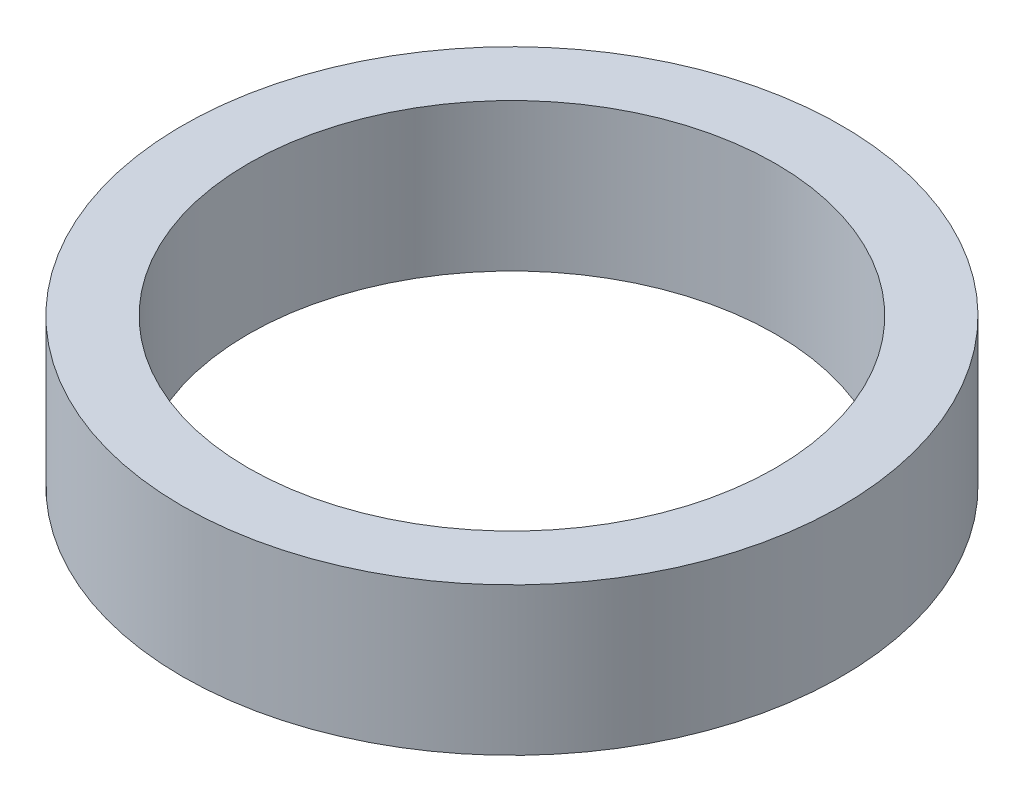
ISO-10303-21;
HEADER;
FILE_DESCRIPTION(('STEP AP214'),'2;1');
FILE_NAME('part.step','',(''),(''),'','','');
FILE_SCHEMA(('AUTOMOTIVE_DESIGN { 1 0 10303 214 1 1 1 1 }'));
ENDSEC;
DATA;
#1=APPLICATION_CONTEXT('core data for automotive mechanical design processes');
#2=APPLICATION_PROTOCOL_DEFINITION('international standard','automotive_design',2000,#1);
#3=PRODUCT_CONTEXT('',#1,'mechanical');
#4=PRODUCT('Part','Part','',(#3));
#5=PRODUCT_RELATED_PRODUCT_CATEGORY('part','',(#4));
#6=PRODUCT_DEFINITION_FORMATION('','',#4);
#7=PRODUCT_DEFINITION_CONTEXT('part definition',#1,'design');
#8=PRODUCT_DEFINITION('design','',#6,#7);
#9=PRODUCT_DEFINITION_SHAPE('','',#8);
#10=(LENGTH_UNIT() NAMED_UNIT(*) SI_UNIT(.MILLI.,.METRE.));
#11=(NAMED_UNIT(*) PLANE_ANGLE_UNIT() SI_UNIT($,.RADIAN.));
#12=(NAMED_UNIT(*) SI_UNIT($,.STERADIAN.) SOLID_ANGLE_UNIT());
#13=UNCERTAINTY_MEASURE_WITH_UNIT(LENGTH_MEASURE(1.E-05),#10,'distance_accuracy_value','');
#14=(GEOMETRIC_REPRESENTATION_CONTEXT(3) GLOBAL_UNCERTAINTY_ASSIGNED_CONTEXT((#13)) GLOBAL_UNIT_ASSIGNED_CONTEXT((#10,
#11,#12)) REPRESENTATION_CONTEXT('',''));
#15=CARTESIAN_POINT('',(0.,0.,0.));
#16=DIRECTION('',(0.,0.,1.));
#17=DIRECTION('',(1.,0.,0.));
#18=AXIS2_PLACEMENT_3D('',#15,#16,#17);
#19=CARTESIAN_POINT('',(0.,28.,0.));
#20=DIRECTION('',(0.,-1.,0.));
#21=DIRECTION('',(0.,0.,-1.));
#22=AXIS2_PLACEMENT_3D('',#19,#20,#21);
#23=CYLINDRICAL_SURFACE('',#22,62.5);
#24=CARTESIAN_POINT('',(0.,28.,0.));
#25=DIRECTION('',(0.,1.,0.));
#26=DIRECTION('',(0.,0.,1.));
#27=AXIS2_PLACEMENT_3D('',#24,#25,#26);
#28=CIRCLE('',#27,62.5);
#29=CARTESIAN_POINT('',(0.,28.,62.5));
#30=VERTEX_POINT('',#29);
#31=EDGE_CURVE('E10',#30,#30,#28,.T.);
#32=ORIENTED_EDGE('',*,*,#31,.F.);
#33=EDGE_LOOP('',(#32));
#34=FACE_BOUND('',#33,.T.);
#35=CARTESIAN_POINT('',(0.,0.,0.));
#36=DIRECTION('',(0.,1.,0.));
#37=DIRECTION('',(0.,0.,1.));
#38=AXIS2_PLACEMENT_3D('',#35,#36,#37);
#39=CIRCLE('',#38,62.5);
#40=CARTESIAN_POINT('',(0.,0.,62.5));
#41=VERTEX_POINT('',#40);
#42=EDGE_CURVE('E37',#41,#41,#39,.T.);
#43=ORIENTED_EDGE('',*,*,#42,.T.);
#44=EDGE_LOOP('',(#43));
#45=FACE_BOUND('',#44,.T.);
#46=ADVANCED_FACE('F40',(#34,#45),#23,.T.);
#47=CARTESIAN_POINT('',(0.,28.,0.));
#48=DIRECTION('',(0.,1.,0.));
#49=DIRECTION('',(0.,0.,1.));
#50=AXIS2_PLACEMENT_3D('',#47,#48,#49);
#51=PLANE('',#50);
#52=CARTESIAN_POINT('',(0.,28.,0.));
#53=DIRECTION('',(0.,1.,0.));
#54=DIRECTION('',(0.,0.,1.));
#55=AXIS2_PLACEMENT_3D('',#52,#53,#54);
#56=CIRCLE('',#55,50.);
#57=CARTESIAN_POINT('',(0.,28.,50.));
#58=VERTEX_POINT('',#57);
#59=EDGE_CURVE('E50',#58,#58,#56,.T.);
#60=ORIENTED_EDGE('',*,*,#59,.F.);
#61=EDGE_LOOP('',(#60));
#62=FACE_BOUND('',#61,.T.);
#63=ORIENTED_EDGE('',*,*,#31,.T.);
#64=EDGE_LOOP('',(#63));
#65=FACE_BOUND('',#64,.T.);
#66=ADVANCED_FACE('F59',(#62,#65),#51,.T.);
#67=CARTESIAN_POINT('',(0.,0.,0.));
#68=DIRECTION('',(0.,1.,0.));
#69=DIRECTION('',(0.,0.,1.));
#70=AXIS2_PLACEMENT_3D('',#67,#68,#69);
#71=PLANE('',#70);
#72=CARTESIAN_POINT('',(0.,0.,0.));
#73=DIRECTION('',(0.,1.,0.));
#74=DIRECTION('',(0.,0.,1.));
#75=AXIS2_PLACEMENT_3D('',#72,#73,#74);
#76=CIRCLE('',#75,50.);
#77=CARTESIAN_POINT('',(0.,0.,50.));
#78=VERTEX_POINT('',#77);
#79=EDGE_CURVE('E47',#78,#78,#76,.T.);
#80=ORIENTED_EDGE('',*,*,#79,.T.);
#81=EDGE_LOOP('',(#80));
#82=FACE_BOUND('',#81,.T.);
#83=ORIENTED_EDGE('',*,*,#42,.F.);
#84=EDGE_LOOP('',(#83));
#85=FACE_BOUND('',#84,.T.);
#86=ADVANCED_FACE('F58',(#82,#85),#71,.F.);
#87=CARTESIAN_POINT('',(0.,28.,0.));
#88=DIRECTION('',(0.,-1.,0.));
#89=DIRECTION('',(0.,0.,-1.));
#90=AXIS2_PLACEMENT_3D('',#87,#88,#89);
#91=CYLINDRICAL_SURFACE('',#90,50.);
#92=ORIENTED_EDGE('',*,*,#59,.T.);
#93=EDGE_LOOP('',(#92));
#94=FACE_BOUND('',#93,.T.);
#95=ORIENTED_EDGE('',*,*,#79,.F.);
#96=EDGE_LOOP('',(#95));
#97=FACE_BOUND('',#96,.T.);
#98=ADVANCED_FACE('F54',(#94,#97),#91,.F.);
#99=CLOSED_SHELL('',(#46,#66,#86,#98));
#100=MANIFOLD_SOLID_BREP('B2',#99);
#101=ADVANCED_BREP_SHAPE_REPRESENTATION('',(#18,#100),#14);
#102=SHAPE_DEFINITION_REPRESENTATION(#9,#101);
ENDSEC;
END-ISO-10303-21;
